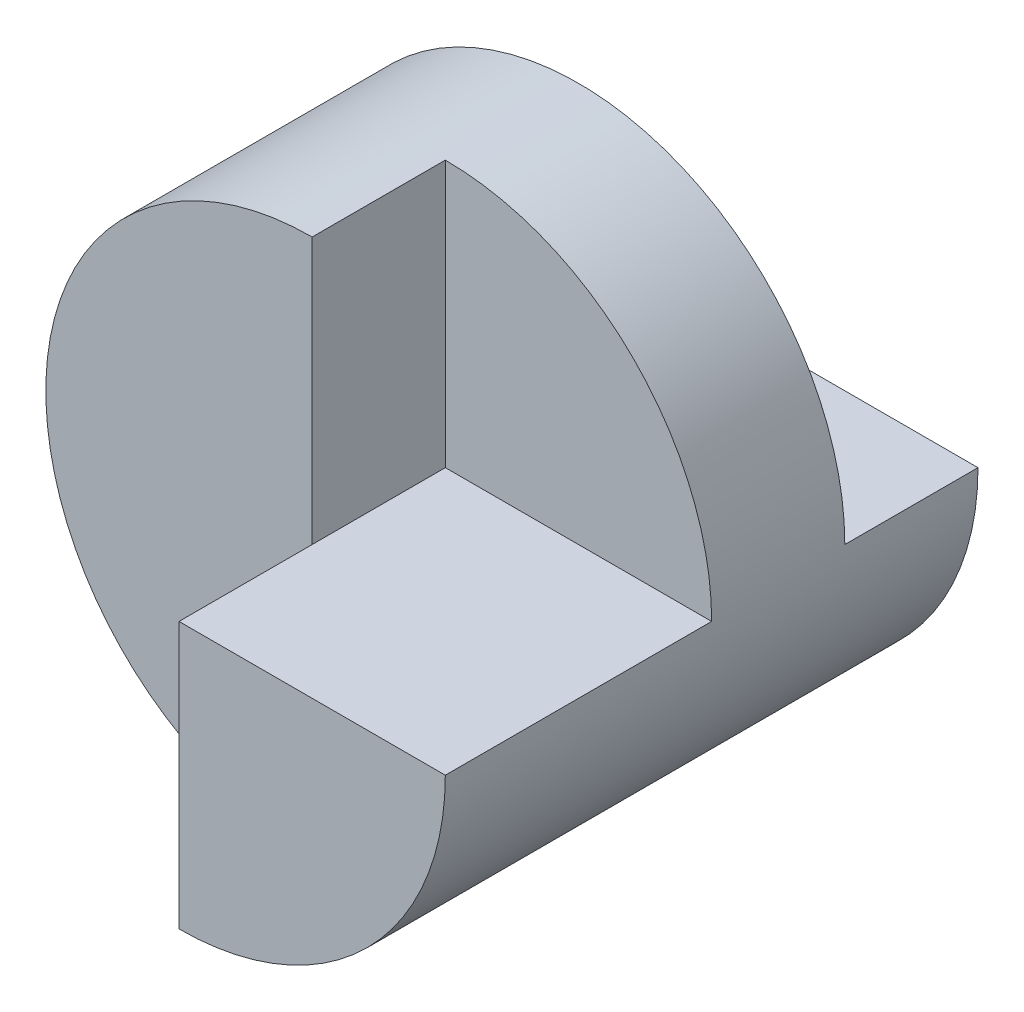
ISO-10303-21;
HEADER;
FILE_DESCRIPTION(('STEP AP214'),'2;1');
FILE_NAME('part.step','',(''),(''),'','','');
FILE_SCHEMA(('AUTOMOTIVE_DESIGN { 1 0 10303 214 1 1 1 1 }'));
ENDSEC;
DATA;
#1=APPLICATION_CONTEXT('core data for automotive mechanical design processes');
#2=APPLICATION_PROTOCOL_DEFINITION('international standard','automotive_design',2000,#1);
#3=PRODUCT_CONTEXT('',#1,'mechanical');
#4=PRODUCT('Part','Part','',(#3));
#5=PRODUCT_RELATED_PRODUCT_CATEGORY('part','',(#4));
#6=PRODUCT_DEFINITION_FORMATION('','',#4);
#7=PRODUCT_DEFINITION_CONTEXT('part definition',#1,'design');
#8=PRODUCT_DEFINITION('design','',#6,#7);
#9=PRODUCT_DEFINITION_SHAPE('','',#8);
#10=(LENGTH_UNIT() NAMED_UNIT(*) SI_UNIT(.MILLI.,.METRE.));
#11=(NAMED_UNIT(*) PLANE_ANGLE_UNIT() SI_UNIT($,.RADIAN.));
#12=(NAMED_UNIT(*) SI_UNIT($,.STERADIAN.) SOLID_ANGLE_UNIT());
#13=UNCERTAINTY_MEASURE_WITH_UNIT(LENGTH_MEASURE(1.E-05),#10,'distance_accuracy_value','');
#14=(GEOMETRIC_REPRESENTATION_CONTEXT(3) GLOBAL_UNCERTAINTY_ASSIGNED_CONTEXT((#13)) GLOBAL_UNIT_ASSIGNED_CONTEXT((#10,
#11,#12)) REPRESENTATION_CONTEXT('',''));
#15=CARTESIAN_POINT('',(0.,0.,0.));
#16=DIRECTION('',(0.,0.,1.));
#17=DIRECTION('',(1.,0.,0.));
#18=AXIS2_PLACEMENT_3D('',#15,#16,#17);
#19=CARTESIAN_POINT('',(0.,0.,40.));
#20=DIRECTION('',(0.,0.,-1.));
#21=DIRECTION('',(-1.,0.,0.));
#22=AXIS2_PLACEMENT_3D('',#19,#20,#21);
#23=PLANE('',#22);
#24=CARTESIAN_POINT('',(20.,20.,40.));
#25=DIRECTION('',(0.,0.,1.));
#26=DIRECTION('',(1.,0.,0.));
#27=AXIS2_PLACEMENT_3D('',#24,#25,#26);
#28=CIRCLE('',#27,20.);
#29=CARTESIAN_POINT('',(20.,0.,40.));
#30=VERTEX_POINT('',#29);
#31=CARTESIAN_POINT('',(40.,20.0000000000001,40.));
#32=VERTEX_POINT('',#31);
#33=EDGE_CURVE('E208',#30,#32,#28,.T.);
#34=ORIENTED_EDGE('',*,*,#33,.T.);
#35=DIRECTION('',(1.,0.,0.));
#36=VECTOR('',#35,1.);
#37=CARTESIAN_POINT('',(20.,20.,40.));
#38=LINE('',#37,#36);
#39=CARTESIAN_POINT('',(20.,20.,40.));
#40=VERTEX_POINT('',#39);
#41=EDGE_CURVE('E179',#40,#32,#38,.T.);
#42=ORIENTED_EDGE('',*,*,#41,.F.);
#43=DIRECTION('',(0.,-1.,0.));
#44=VECTOR('',#43,1.);
#45=CARTESIAN_POINT('',(20.,40.,40.));
#46=LINE('',#45,#44);
#47=EDGE_CURVE('E206',#40,#30,#46,.T.);
#48=ORIENTED_EDGE('',*,*,#47,.T.);
#49=EDGE_LOOP('',(#34,#42,#48));
#50=FACE_BOUND('',#49,.T.);
#51=ADVANCED_FACE('F105',(#50),#23,.F.);
#52=CARTESIAN_POINT('',(20.,20.,0.));
#53=DIRECTION('',(0.,0.,1.));
#54=DIRECTION('',(1.,0.,0.));
#55=AXIS2_PLACEMENT_3D('',#52,#53,#54);
#56=CYLINDRICAL_SURFACE('',#55,20.);
#57=DIRECTION('',(0.,0.,-1.));
#58=VECTOR('',#57,1.);
#59=CARTESIAN_POINT('',(40.,20.,10.));
#60=LINE('',#59,#58);
#61=CARTESIAN_POINT('',(40.,20.,10.));
#62=VERTEX_POINT('',#61);
#63=CARTESIAN_POINT('',(40.,20.,0.));
#64=VERTEX_POINT('',#63);
#65=EDGE_CURVE('E120',#62,#64,#60,.T.);
#66=ORIENTED_EDGE('',*,*,#65,.F.);
#67=CARTESIAN_POINT('',(20.,20.,10.));
#68=DIRECTION('',(0.,0.,-1.));
#69=DIRECTION('',(1.,0.,0.));
#70=AXIS2_PLACEMENT_3D('',#67,#68,#69);
#71=CIRCLE('',#70,20.);
#72=CARTESIAN_POINT('',(0.,20.,10.));
#73=VERTEX_POINT('',#72);
#74=EDGE_CURVE('E164',#73,#62,#71,.T.);
#75=ORIENTED_EDGE('',*,*,#74,.F.);
#76=DIRECTION('',(0.,0.,-1.));
#77=VECTOR('',#76,1.);
#78=CARTESIAN_POINT('',(0.,20.,10.));
#79=LINE('',#78,#77);
#80=CARTESIAN_POINT('',(0.,20.,0.));
#81=VERTEX_POINT('',#80);
#82=EDGE_CURVE('E172',#73,#81,#79,.T.);
#83=ORIENTED_EDGE('',*,*,#82,.T.);
#84=CARTESIAN_POINT('',(20.,20.,0.));
#85=DIRECTION('',(0.,0.,1.));
#86=DIRECTION('',(1.,0.,0.));
#87=AXIS2_PLACEMENT_3D('',#84,#85,#86);
#88=CIRCLE('',#87,20.);
#89=EDGE_CURVE('E113',#81,#64,#88,.T.);
#90=ORIENTED_EDGE('',*,*,#89,.T.);
#91=EDGE_LOOP('',(#66,#75,#83,#90));
#92=FACE_BOUND('',#91,.T.);
#93=DIRECTION('',(0.,0.,1.));
#94=VECTOR('',#93,1.);
#95=CARTESIAN_POINT('',(40.,20.0000000000001,20.));
#96=LINE('',#95,#94);
#97=CARTESIAN_POINT('',(40.,20.0000000000001,20.));
#98=VERTEX_POINT('',#97);
#99=EDGE_CURVE('E191',#98,#32,#96,.T.);
#100=ORIENTED_EDGE('',*,*,#99,.T.);
#101=ORIENTED_EDGE('',*,*,#33,.F.);
#102=DIRECTION('',(0.,0.,-1.));
#103=VECTOR('',#102,1.);
#104=CARTESIAN_POINT('',(20.,0.,40.));
#105=LINE('',#104,#103);
#106=CARTESIAN_POINT('',(20.,0.,30.));
#107=VERTEX_POINT('',#106);
#108=EDGE_CURVE('E196',#30,#107,#105,.T.);
#109=ORIENTED_EDGE('',*,*,#108,.T.);
#110=CARTESIAN_POINT('',(20.,20.,30.));
#111=DIRECTION('',(0.,0.,1.));
#112=DIRECTION('',(1.,0.,0.));
#113=AXIS2_PLACEMENT_3D('',#110,#111,#112);
#114=CIRCLE('',#113,20.);
#115=CARTESIAN_POINT('',(20.,40.,30.));
#116=VERTEX_POINT('',#115);
#117=EDGE_CURVE('E12',#107,#116,#114,.F.);
#118=ORIENTED_EDGE('',*,*,#117,.T.);
#119=DIRECTION('',(0.,0.,1.));
#120=VECTOR('',#119,1.);
#121=CARTESIAN_POINT('',(19.9999999999999,40.,20.));
#122=LINE('',#121,#120);
#123=CARTESIAN_POINT('',(19.9999999999999,40.,20.));
#124=VERTEX_POINT('',#123);
#125=EDGE_CURVE('E198',#124,#116,#122,.T.);
#126=ORIENTED_EDGE('',*,*,#125,.F.);
#127=CARTESIAN_POINT('',(20.,20.,20.));
#128=DIRECTION('',(0.,0.,1.));
#129=DIRECTION('',(-1.,0.,0.));
#130=AXIS2_PLACEMENT_3D('',#127,#128,#129);
#131=CIRCLE('',#130,20.);
#132=EDGE_CURVE('E186',#98,#124,#131,.T.);
#133=ORIENTED_EDGE('',*,*,#132,.F.);
#134=EDGE_LOOP('',(#100,#101,#109,#118,#126,#133));
#135=FACE_BOUND('',#134,.T.);
#136=ADVANCED_FACE('F175',(#92,#135),#56,.T.);
#137=CARTESIAN_POINT('',(0.,0.,0.));
#138=DIRECTION('',(0.,0.,-1.));
#139=DIRECTION('',(-1.,0.,0.));
#140=AXIS2_PLACEMENT_3D('',#137,#138,#139);
#141=PLANE('',#140);
#142=DIRECTION('',(-1.,0.,0.));
#143=VECTOR('',#142,1.);
#144=CARTESIAN_POINT('',(0.,20.,0.));
#145=LINE('',#144,#143);
#146=EDGE_CURVE('E169',#64,#81,#145,.T.);
#147=ORIENTED_EDGE('',*,*,#146,.F.);
#148=ORIENTED_EDGE('',*,*,#89,.F.);
#149=EDGE_LOOP('',(#147,#148));
#150=FACE_BOUND('',#149,.T.);
#151=ADVANCED_FACE('F107',(#150),#141,.T.);
#152=CARTESIAN_POINT('',(20.,40.,40.));
#153=DIRECTION('',(-1.,0.,0.));
#154=DIRECTION('',(0.,0.,1.));
#155=AXIS2_PLACEMENT_3D('',#152,#153,#154);
#156=PLANE('',#155);
#157=DIRECTION('',(0.,0.,1.));
#158=VECTOR('',#157,1.);
#159=CARTESIAN_POINT('',(20.,20.,20.));
#160=LINE('',#159,#158);
#161=CARTESIAN_POINT('',(20.,20.,30.));
#162=VERTEX_POINT('',#161);
#163=EDGE_CURVE('E197',#162,#40,#160,.T.);
#164=ORIENTED_EDGE('',*,*,#163,.F.);
#165=DIRECTION('',(0.,-1.,0.));
#166=VECTOR('',#165,1.);
#167=CARTESIAN_POINT('',(20.,40.,30.));
#168=LINE('',#167,#166);
#169=EDGE_CURVE('E128',#162,#107,#168,.T.);
#170=ORIENTED_EDGE('',*,*,#169,.T.);
#171=ORIENTED_EDGE('',*,*,#108,.F.);
#172=ORIENTED_EDGE('',*,*,#47,.F.);
#173=EDGE_LOOP('',(#164,#170,#171,#172));
#174=FACE_BOUND('',#173,.T.);
#175=ADVANCED_FACE('F227',(#174),#156,.T.);
#176=CARTESIAN_POINT('',(0.,40.,30.));
#177=DIRECTION('',(0.,0.,1.));
#178=DIRECTION('',(1.,0.,0.));
#179=AXIS2_PLACEMENT_3D('',#176,#177,#178);
#180=PLANE('',#179);
#181=EDGE_CURVE('E204',#116,#162,#168,.T.);
#182=ORIENTED_EDGE('',*,*,#181,.F.);
#183=ORIENTED_EDGE('',*,*,#117,.F.);
#184=ORIENTED_EDGE('',*,*,#169,.F.);
#185=EDGE_LOOP('',(#182,#183,#184));
#186=FACE_BOUND('',#185,.T.);
#187=ADVANCED_FACE('F226',(#186),#180,.T.);
#188=CARTESIAN_POINT('',(20.,20.,20.));
#189=DIRECTION('',(0.,-1.,0.));
#190=DIRECTION('',(1.,0.,0.));
#191=AXIS2_PLACEMENT_3D('',#188,#189,#190);
#192=PLANE('',#191);
#193=ORIENTED_EDGE('',*,*,#41,.T.);
#194=ORIENTED_EDGE('',*,*,#99,.F.);
#195=DIRECTION('',(1.,0.,0.));
#196=VECTOR('',#195,1.);
#197=CARTESIAN_POINT('',(20.,20.,20.));
#198=LINE('',#197,#196);
#199=CARTESIAN_POINT('',(20.,20.,20.));
#200=VERTEX_POINT('',#199);
#201=EDGE_CURVE('E183',#200,#98,#198,.T.);
#202=ORIENTED_EDGE('',*,*,#201,.F.);
#203=EDGE_CURVE('E193',#200,#162,#160,.T.);
#204=ORIENTED_EDGE('',*,*,#203,.T.);
#205=ORIENTED_EDGE('',*,*,#163,.T.);
#206=EDGE_LOOP('',(#193,#194,#202,#204,#205));
#207=FACE_BOUND('',#206,.T.);
#208=ADVANCED_FACE('F218',(#207),#192,.F.);
#209=CARTESIAN_POINT('',(20.,20.,20.));
#210=DIRECTION('',(-1.,0.,0.));
#211=DIRECTION('',(0.,-1.,0.));
#212=AXIS2_PLACEMENT_3D('',#209,#210,#211);
#213=PLANE('',#212);
#214=ORIENTED_EDGE('',*,*,#181,.T.);
#215=ORIENTED_EDGE('',*,*,#203,.F.);
#216=DIRECTION('',(0.,-1.,0.));
#217=VECTOR('',#216,1.);
#218=CARTESIAN_POINT('',(20.,20.,20.));
#219=LINE('',#218,#217);
#220=EDGE_CURVE('E188',#124,#200,#219,.T.);
#221=ORIENTED_EDGE('',*,*,#220,.F.);
#222=ORIENTED_EDGE('',*,*,#125,.T.);
#223=EDGE_LOOP('',(#214,#215,#221,#222));
#224=FACE_BOUND('',#223,.T.);
#225=ADVANCED_FACE('F223',(#224),#213,.F.);
#226=CARTESIAN_POINT('',(20.,20.,20.));
#227=DIRECTION('',(0.,0.,-1.));
#228=DIRECTION('',(-1.,0.,0.));
#229=AXIS2_PLACEMENT_3D('',#226,#227,#228);
#230=PLANE('',#229);
#231=ORIENTED_EDGE('',*,*,#201,.T.);
#232=ORIENTED_EDGE('',*,*,#132,.T.);
#233=ORIENTED_EDGE('',*,*,#220,.T.);
#234=EDGE_LOOP('',(#231,#232,#233));
#235=FACE_BOUND('',#234,.T.);
#236=ADVANCED_FACE('F220',(#235),#230,.F.);
#237=CARTESIAN_POINT('',(0.,20.,10.));
#238=DIRECTION('',(0.,-1.,0.));
#239=DIRECTION('',(0.,0.,-1.));
#240=AXIS2_PLACEMENT_3D('',#237,#238,#239);
#241=PLANE('',#240);
#242=ORIENTED_EDGE('',*,*,#146,.T.);
#243=ORIENTED_EDGE('',*,*,#82,.F.);
#244=DIRECTION('',(-1.,0.,0.));
#245=VECTOR('',#244,1.);
#246=CARTESIAN_POINT('',(0.,20.,10.));
#247=LINE('',#246,#245);
#248=EDGE_CURVE('E166',#62,#73,#247,.T.);
#249=ORIENTED_EDGE('',*,*,#248,.F.);
#250=ORIENTED_EDGE('',*,*,#65,.T.);
#251=EDGE_LOOP('',(#242,#243,#249,#250));
#252=FACE_BOUND('',#251,.T.);
#253=ADVANCED_FACE('F171',(#252),#241,.F.);
#254=CARTESIAN_POINT('',(20.,20.,10.));
#255=DIRECTION('',(0.,0.,1.));
#256=DIRECTION('',(1.,0.,0.));
#257=AXIS2_PLACEMENT_3D('',#254,#255,#256);
#258=PLANE('',#257);
#259=ORIENTED_EDGE('',*,*,#74,.T.);
#260=ORIENTED_EDGE('',*,*,#248,.T.);
#261=EDGE_LOOP('',(#259,#260));
#262=FACE_BOUND('',#261,.T.);
#263=ADVANCED_FACE('F165',(#262),#258,.F.);
#264=CLOSED_SHELL('',(#51,#136,#151,#175,#187,#208,#225,#236,#253,#263));
#265=MANIFOLD_SOLID_BREP('B2',#264);
#266=ADVANCED_BREP_SHAPE_REPRESENTATION('',(#18,#265),#14);
#267=SHAPE_DEFINITION_REPRESENTATION(#9,#266);
ENDSEC;
END-ISO-10303-21;
